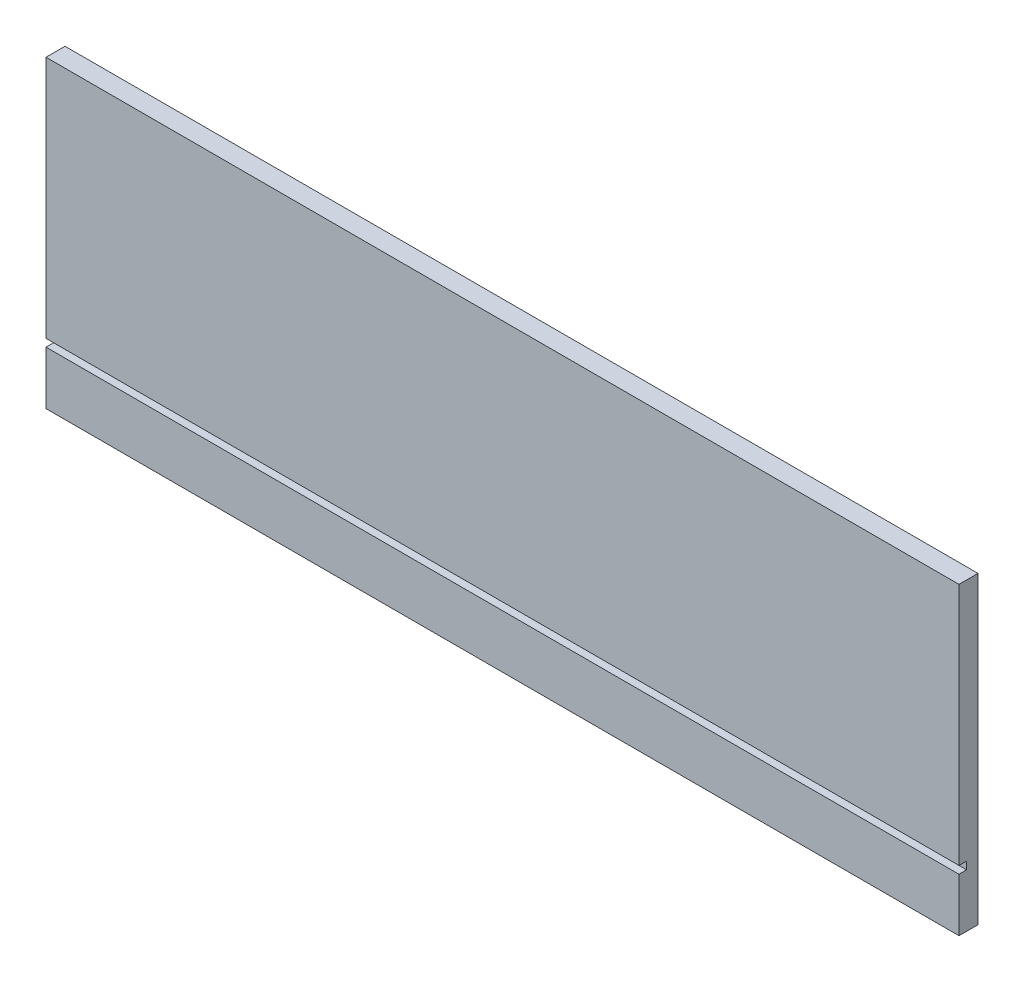
ISO-10303-21;
HEADER;
FILE_DESCRIPTION(('STEP AP214'),'2;1');
FILE_NAME('part.step','',(''),(''),'','','');
FILE_SCHEMA(('AUTOMOTIVE_DESIGN { 1 0 10303 214 1 1 1 1 }'));
ENDSEC;
DATA;
#1=APPLICATION_CONTEXT('core data for automotive mechanical design processes');
#2=APPLICATION_PROTOCOL_DEFINITION('international standard','automotive_design',2000,#1);
#3=PRODUCT_CONTEXT('',#1,'mechanical');
#4=PRODUCT('Part','Part','',(#3));
#5=PRODUCT_RELATED_PRODUCT_CATEGORY('part','',(#4));
#6=PRODUCT_DEFINITION_FORMATION('','',#4);
#7=PRODUCT_DEFINITION_CONTEXT('part definition',#1,'design');
#8=PRODUCT_DEFINITION('design','',#6,#7);
#9=PRODUCT_DEFINITION_SHAPE('','',#8);
#10=(LENGTH_UNIT() NAMED_UNIT(*) SI_UNIT(.MILLI.,.METRE.));
#11=(NAMED_UNIT(*) PLANE_ANGLE_UNIT() SI_UNIT($,.RADIAN.));
#12=(NAMED_UNIT(*) SI_UNIT($,.STERADIAN.) SOLID_ANGLE_UNIT());
#13=UNCERTAINTY_MEASURE_WITH_UNIT(LENGTH_MEASURE(1.E-05),#10,'distance_accuracy_value','');
#14=(GEOMETRIC_REPRESENTATION_CONTEXT(3) GLOBAL_UNCERTAINTY_ASSIGNED_CONTEXT((#13)) GLOBAL_UNIT_ASSIGNED_CONTEXT((#10,
#11,#12)) REPRESENTATION_CONTEXT('',''));
#15=CARTESIAN_POINT('',(0.,0.,0.));
#16=DIRECTION('',(0.,0.,1.));
#17=DIRECTION('',(1.,0.,0.));
#18=AXIS2_PLACEMENT_3D('',#15,#16,#17);
#19=CARTESIAN_POINT('',(0.,0.,15.875));
#20=DIRECTION('',(0.,0.,-1.));
#21=DIRECTION('',(-1.,0.,0.));
#22=AXIS2_PLACEMENT_3D('',#19,#20,#21);
#23=PLANE('',#22);
#24=DIRECTION('',(0.,-1.,0.));
#25=VECTOR('',#24,1.);
#26=CARTESIAN_POINT('',(0.,0.,15.875));
#27=LINE('',#26,#25);
#28=CARTESIAN_POINT('',(0.,254.,15.875));
#29=VERTEX_POINT('',#28);
#30=CARTESIAN_POINT('',(0.,50.8,15.875));
#31=VERTEX_POINT('',#30);
#32=EDGE_CURVE('E140',#29,#31,#27,.T.);
#33=ORIENTED_EDGE('',*,*,#32,.T.);
#34=DIRECTION('',(1.,0.,0.));
#35=VECTOR('',#34,1.);
#36=CARTESIAN_POINT('',(0.,50.8,15.875));
#37=LINE('',#36,#35);
#38=CARTESIAN_POINT('',(762.,50.8,15.875));
#39=VERTEX_POINT('',#38);
#40=EDGE_CURVE('E134',#31,#39,#37,.T.);
#41=ORIENTED_EDGE('',*,*,#40,.T.);
#42=DIRECTION('',(0.,1.,0.));
#43=VECTOR('',#42,1.);
#44=CARTESIAN_POINT('',(762.,0.,15.875));
#45=LINE('',#44,#43);
#46=CARTESIAN_POINT('',(762.,254.,15.875));
#47=VERTEX_POINT('',#46);
#48=EDGE_CURVE('E144',#39,#47,#45,.T.);
#49=ORIENTED_EDGE('',*,*,#48,.T.);
#50=DIRECTION('',(-1.,0.,0.));
#51=VECTOR('',#50,1.);
#52=CARTESIAN_POINT('',(0.,254.,15.875));
#53=LINE('',#52,#51);
#54=EDGE_CURVE('E57',#47,#29,#53,.T.);
#55=ORIENTED_EDGE('',*,*,#54,.T.);
#56=EDGE_LOOP('',(#33,#41,#49,#55));
#57=FACE_BOUND('',#56,.T.);
#58=ADVANCED_FACE('F33',(#57),#23,.F.);
#59=CARTESIAN_POINT('',(0.,0.,15.875));
#60=DIRECTION('',(1.,0.,0.));
#61=DIRECTION('',(0.,0.,-1.));
#62=AXIS2_PLACEMENT_3D('',#59,#60,#61);
#63=PLANE('',#62);
#64=DIRECTION('',(0.,1.,0.));
#65=VECTOR('',#64,1.);
#66=CARTESIAN_POINT('',(0.,50.8,9.525));
#67=LINE('',#66,#65);
#68=CARTESIAN_POINT('',(0.,44.45,9.525));
#69=VERTEX_POINT('',#68);
#70=CARTESIAN_POINT('',(0.,50.8,9.525));
#71=VERTEX_POINT('',#70);
#72=EDGE_CURVE('E118',#69,#71,#67,.T.);
#73=ORIENTED_EDGE('',*,*,#72,.T.);
#74=DIRECTION('',(0.,0.,1.));
#75=VECTOR('',#74,1.);
#76=CARTESIAN_POINT('',(0.,50.8,15.875));
#77=LINE('',#76,#75);
#78=EDGE_CURVE('E123',#71,#31,#77,.T.);
#79=ORIENTED_EDGE('',*,*,#78,.T.);
#80=ORIENTED_EDGE('',*,*,#32,.F.);
#81=DIRECTION('',(0.,0.,-1.));
#82=VECTOR('',#81,1.);
#83=CARTESIAN_POINT('',(0.,254.,15.875));
#84=LINE('',#83,#82);
#85=CARTESIAN_POINT('',(0.,254.,0.));
#86=VERTEX_POINT('',#85);
#87=EDGE_CURVE('E149',#29,#86,#84,.T.);
#88=ORIENTED_EDGE('',*,*,#87,.T.);
#89=DIRECTION('',(0.,-1.,0.));
#90=VECTOR('',#89,1.);
#91=CARTESIAN_POINT('',(0.,0.,0.));
#92=LINE('',#91,#90);
#93=CARTESIAN_POINT('',(0.,0.,0.));
#94=VERTEX_POINT('',#93);
#95=EDGE_CURVE('E137',#86,#94,#92,.T.);
#96=ORIENTED_EDGE('',*,*,#95,.T.);
#97=DIRECTION('',(0.,0.,-1.));
#98=VECTOR('',#97,1.);
#99=CARTESIAN_POINT('',(0.,0.,15.875));
#100=LINE('',#99,#98);
#101=CARTESIAN_POINT('',(0.,0.,15.875));
#102=VERTEX_POINT('',#101);
#103=EDGE_CURVE('E11',#102,#94,#100,.T.);
#104=ORIENTED_EDGE('',*,*,#103,.F.);
#105=CARTESIAN_POINT('',(0.,44.45,15.875));
#106=VERTEX_POINT('',#105);
#107=EDGE_CURVE('E85',#106,#102,#27,.T.);
#108=ORIENTED_EDGE('',*,*,#107,.F.);
#109=DIRECTION('',(0.,0.,-1.));
#110=VECTOR('',#109,1.);
#111=CARTESIAN_POINT('',(0.,44.45,15.875));
#112=LINE('',#111,#110);
#113=EDGE_CURVE('E48',#106,#69,#112,.T.);
#114=ORIENTED_EDGE('',*,*,#113,.T.);
#115=EDGE_LOOP('',(#73,#79,#80,#88,#96,#104,#108,#114));
#116=FACE_BOUND('',#115,.T.);
#117=ADVANCED_FACE('F35',(#116),#63,.F.);
#118=CARTESIAN_POINT('',(0.,0.,15.875));
#119=DIRECTION('',(0.,1.,0.));
#120=DIRECTION('',(0.,0.,1.));
#121=AXIS2_PLACEMENT_3D('',#118,#119,#120);
#122=PLANE('',#121);
#123=DIRECTION('',(1.,0.,0.));
#124=VECTOR('',#123,1.);
#125=CARTESIAN_POINT('',(0.,0.,0.));
#126=LINE('',#125,#124);
#127=CARTESIAN_POINT('',(762.,0.,0.));
#128=VERTEX_POINT('',#127);
#129=EDGE_CURVE('E152',#94,#128,#126,.T.);
#130=ORIENTED_EDGE('',*,*,#129,.T.);
#131=DIRECTION('',(0.,0.,-1.));
#132=VECTOR('',#131,1.);
#133=CARTESIAN_POINT('',(762.,0.,15.875));
#134=LINE('',#133,#132);
#135=CARTESIAN_POINT('',(762.,0.,15.875));
#136=VERTEX_POINT('',#135);
#137=EDGE_CURVE('E41',#136,#128,#134,.T.);
#138=ORIENTED_EDGE('',*,*,#137,.F.);
#139=DIRECTION('',(1.,0.,0.));
#140=VECTOR('',#139,1.);
#141=CARTESIAN_POINT('',(0.,0.,15.875));
#142=LINE('',#141,#140);
#143=EDGE_CURVE('E142',#102,#136,#142,.T.);
#144=ORIENTED_EDGE('',*,*,#143,.F.);
#145=ORIENTED_EDGE('',*,*,#103,.T.);
#146=EDGE_LOOP('',(#130,#138,#144,#145));
#147=FACE_BOUND('',#146,.T.);
#148=ADVANCED_FACE('F177',(#147),#122,.F.);
#149=CARTESIAN_POINT('',(762.,0.,15.875));
#150=DIRECTION('',(-1.,0.,0.));
#151=DIRECTION('',(0.,0.,1.));
#152=AXIS2_PLACEMENT_3D('',#149,#150,#151);
#153=PLANE('',#152);
#154=ORIENTED_EDGE('',*,*,#48,.F.);
#155=DIRECTION('',(0.,0.,1.));
#156=VECTOR('',#155,1.);
#157=CARTESIAN_POINT('',(762.,50.8,15.875));
#158=LINE('',#157,#156);
#159=CARTESIAN_POINT('',(762.,50.8,9.525));
#160=VERTEX_POINT('',#159);
#161=EDGE_CURVE('E126',#160,#39,#158,.T.);
#162=ORIENTED_EDGE('',*,*,#161,.F.);
#163=DIRECTION('',(0.,1.,0.));
#164=VECTOR('',#163,1.);
#165=CARTESIAN_POINT('',(762.,50.8,9.525));
#166=LINE('',#165,#164);
#167=CARTESIAN_POINT('',(762.,44.45,9.525));
#168=VERTEX_POINT('',#167);
#169=EDGE_CURVE('E128',#168,#160,#166,.T.);
#170=ORIENTED_EDGE('',*,*,#169,.F.);
#171=DIRECTION('',(0.,0.,-1.));
#172=VECTOR('',#171,1.);
#173=CARTESIAN_POINT('',(762.,44.45,15.875));
#174=LINE('',#173,#172);
#175=CARTESIAN_POINT('',(762.,44.45,15.875));
#176=VERTEX_POINT('',#175);
#177=EDGE_CURVE('E110',#176,#168,#174,.T.);
#178=ORIENTED_EDGE('',*,*,#177,.F.);
#179=EDGE_CURVE('E145',#136,#176,#45,.T.);
#180=ORIENTED_EDGE('',*,*,#179,.F.);
#181=ORIENTED_EDGE('',*,*,#137,.T.);
#182=DIRECTION('',(0.,1.,0.));
#183=VECTOR('',#182,1.);
#184=CARTESIAN_POINT('',(762.,0.,0.));
#185=LINE('',#184,#183);
#186=CARTESIAN_POINT('',(762.,254.,0.));
#187=VERTEX_POINT('',#186);
#188=EDGE_CURVE('E154',#128,#187,#185,.T.);
#189=ORIENTED_EDGE('',*,*,#188,.T.);
#190=DIRECTION('',(0.,0.,-1.));
#191=VECTOR('',#190,1.);
#192=CARTESIAN_POINT('',(762.,254.,15.875));
#193=LINE('',#192,#191);
#194=EDGE_CURVE('E158',#47,#187,#193,.T.);
#195=ORIENTED_EDGE('',*,*,#194,.F.);
#196=EDGE_LOOP('',(#154,#162,#170,#178,#180,#181,#189,#195));
#197=FACE_BOUND('',#196,.T.);
#198=ADVANCED_FACE('F165',(#197),#153,.F.);
#199=CARTESIAN_POINT('',(0.,254.,15.875));
#200=DIRECTION('',(0.,-1.,0.));
#201=DIRECTION('',(0.,0.,-1.));
#202=AXIS2_PLACEMENT_3D('',#199,#200,#201);
#203=PLANE('',#202);
#204=DIRECTION('',(-1.,0.,0.));
#205=VECTOR('',#204,1.);
#206=CARTESIAN_POINT('',(0.,254.,0.));
#207=LINE('',#206,#205);
#208=EDGE_CURVE('E78',#187,#86,#207,.T.);
#209=ORIENTED_EDGE('',*,*,#208,.T.);
#210=ORIENTED_EDGE('',*,*,#87,.F.);
#211=ORIENTED_EDGE('',*,*,#54,.F.);
#212=ORIENTED_EDGE('',*,*,#194,.T.);
#213=EDGE_LOOP('',(#209,#210,#211,#212));
#214=FACE_BOUND('',#213,.T.);
#215=ADVANCED_FACE('F172',(#214),#203,.F.);
#216=ORIENTED_EDGE('',*,*,#179,.T.);
#217=DIRECTION('',(1.,0.,0.));
#218=VECTOR('',#217,1.);
#219=CARTESIAN_POINT('',(0.,44.45,15.875));
#220=LINE('',#219,#218);
#221=EDGE_CURVE('E115',#106,#176,#220,.T.);
#222=ORIENTED_EDGE('',*,*,#221,.F.);
#223=ORIENTED_EDGE('',*,*,#107,.T.);
#224=ORIENTED_EDGE('',*,*,#143,.T.);
#225=EDGE_LOOP('',(#216,#222,#223,#224));
#226=FACE_BOUND('',#225,.T.);
#227=ADVANCED_FACE('F176',(#226),#23,.F.);
#228=CARTESIAN_POINT('',(0.,0.,0.));
#229=DIRECTION('',(0.,0.,-1.));
#230=DIRECTION('',(-1.,0.,0.));
#231=AXIS2_PLACEMENT_3D('',#228,#229,#230);
#232=PLANE('',#231);
#233=ORIENTED_EDGE('',*,*,#95,.F.);
#234=ORIENTED_EDGE('',*,*,#208,.F.);
#235=ORIENTED_EDGE('',*,*,#188,.F.);
#236=ORIENTED_EDGE('',*,*,#129,.F.);
#237=EDGE_LOOP('',(#233,#234,#235,#236));
#238=FACE_BOUND('',#237,.T.);
#239=ADVANCED_FACE('F170',(#238),#232,.T.);
#240=CARTESIAN_POINT('',(0.,50.8,15.875));
#241=DIRECTION('',(0.,1.,0.));
#242=DIRECTION('',(0.,0.,1.));
#243=AXIS2_PLACEMENT_3D('',#240,#241,#242);
#244=PLANE('',#243);
#245=ORIENTED_EDGE('',*,*,#161,.T.);
#246=ORIENTED_EDGE('',*,*,#40,.F.);
#247=ORIENTED_EDGE('',*,*,#78,.F.);
#248=DIRECTION('',(1.,0.,0.));
#249=VECTOR('',#248,1.);
#250=CARTESIAN_POINT('',(0.,50.8,9.525));
#251=LINE('',#250,#249);
#252=EDGE_CURVE('E114',#71,#160,#251,.T.);
#253=ORIENTED_EDGE('',*,*,#252,.T.);
#254=EDGE_LOOP('',(#245,#246,#247,#253));
#255=FACE_BOUND('',#254,.T.);
#256=ADVANCED_FACE('F175',(#255),#244,.F.);
#257=CARTESIAN_POINT('',(0.,50.8,9.525));
#258=DIRECTION('',(0.,0.,-1.));
#259=DIRECTION('',(0.,1.,0.));
#260=AXIS2_PLACEMENT_3D('',#257,#258,#259);
#261=PLANE('',#260);
#262=ORIENTED_EDGE('',*,*,#169,.T.);
#263=ORIENTED_EDGE('',*,*,#252,.F.);
#264=ORIENTED_EDGE('',*,*,#72,.F.);
#265=DIRECTION('',(1.,0.,0.));
#266=VECTOR('',#265,1.);
#267=CARTESIAN_POINT('',(0.,44.45,9.525));
#268=LINE('',#267,#266);
#269=EDGE_CURVE('E106',#69,#168,#268,.T.);
#270=ORIENTED_EDGE('',*,*,#269,.T.);
#271=EDGE_LOOP('',(#262,#263,#264,#270));
#272=FACE_BOUND('',#271,.T.);
#273=ADVANCED_FACE('F119',(#272),#261,.F.);
#274=CARTESIAN_POINT('',(0.,44.45,15.875));
#275=DIRECTION('',(0.,-1.,0.));
#276=DIRECTION('',(0.,0.,-1.));
#277=AXIS2_PLACEMENT_3D('',#274,#275,#276);
#278=PLANE('',#277);
#279=ORIENTED_EDGE('',*,*,#177,.T.);
#280=ORIENTED_EDGE('',*,*,#269,.F.);
#281=ORIENTED_EDGE('',*,*,#113,.F.);
#282=ORIENTED_EDGE('',*,*,#221,.T.);
#283=EDGE_LOOP('',(#279,#280,#281,#282));
#284=FACE_BOUND('',#283,.T.);
#285=ADVANCED_FACE('F108',(#284),#278,.F.);
#286=CLOSED_SHELL('',(#58,#117,#148,#198,#215,#227,#239,#256,#273,#285));
#287=MANIFOLD_SOLID_BREP('B2',#286);
#288=ADVANCED_BREP_SHAPE_REPRESENTATION('',(#18,#287),#14);
#289=SHAPE_DEFINITION_REPRESENTATION(#9,#288);
ENDSEC;
END-ISO-10303-21;
